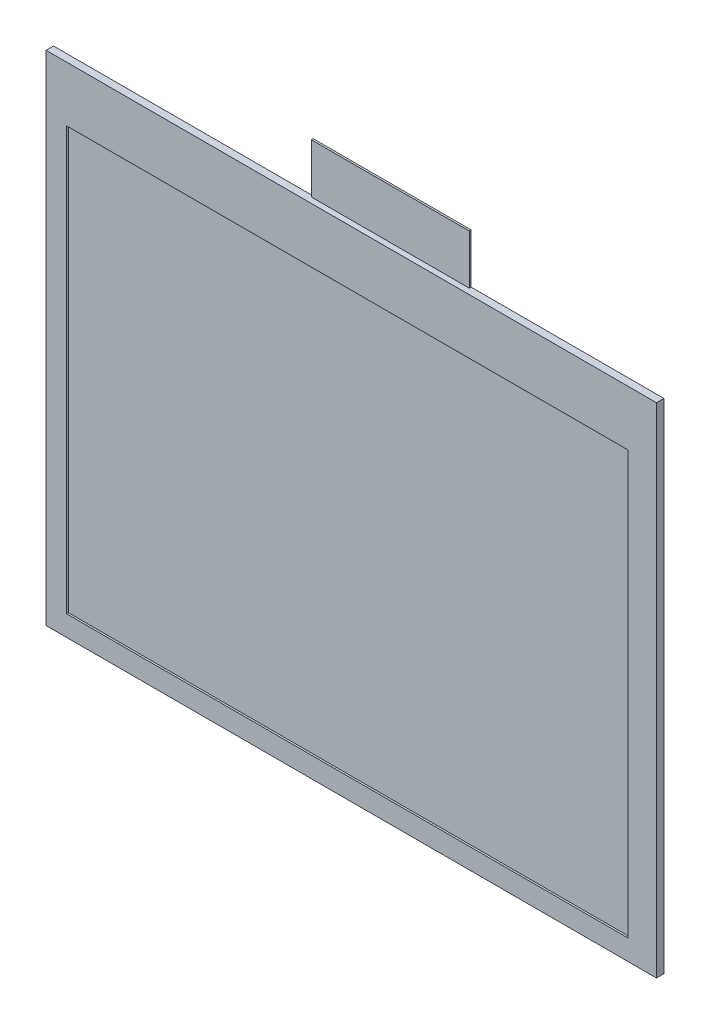
ISO-10303-21;
HEADER;
FILE_DESCRIPTION(('STEP AP214'),'2;1');
FILE_NAME('part.step','',(''),(''),'','','');
FILE_SCHEMA(('AUTOMOTIVE_DESIGN { 1 0 10303 214 1 1 1 1 }'));
ENDSEC;
DATA;
#1=APPLICATION_CONTEXT('core data for automotive mechanical design processes');
#2=APPLICATION_PROTOCOL_DEFINITION('international standard','automotive_design',2000,#1);
#3=PRODUCT_CONTEXT('',#1,'mechanical');
#4=PRODUCT('Part','Part','',(#3));
#5=PRODUCT_RELATED_PRODUCT_CATEGORY('part','',(#4));
#6=PRODUCT_DEFINITION_FORMATION('','',#4);
#7=PRODUCT_DEFINITION_CONTEXT('part definition',#1,'design');
#8=PRODUCT_DEFINITION('design','',#6,#7);
#9=PRODUCT_DEFINITION_SHAPE('','',#8);
#10=(LENGTH_UNIT() NAMED_UNIT(*) SI_UNIT(.MILLI.,.METRE.));
#11=(NAMED_UNIT(*) PLANE_ANGLE_UNIT() SI_UNIT($,.RADIAN.));
#12=(NAMED_UNIT(*) SI_UNIT($,.STERADIAN.) SOLID_ANGLE_UNIT());
#13=UNCERTAINTY_MEASURE_WITH_UNIT(LENGTH_MEASURE(1.E-05),#10,'distance_accuracy_value','');
#14=(GEOMETRIC_REPRESENTATION_CONTEXT(3) GLOBAL_UNCERTAINTY_ASSIGNED_CONTEXT((#13)) GLOBAL_UNIT_ASSIGNED_CONTEXT((#10,
#11,#12)) REPRESENTATION_CONTEXT('',''));
#15=CARTESIAN_POINT('',(0.,0.,0.));
#16=DIRECTION('',(0.,0.,1.));
#17=DIRECTION('',(1.,0.,0.));
#18=AXIS2_PLACEMENT_3D('',#15,#16,#17);
#19=CARTESIAN_POINT('',(0.,-37.4,1.2));
#20=DIRECTION('',(0.,1.,0.));
#21=DIRECTION('',(0.,0.,1.));
#22=AXIS2_PLACEMENT_3D('',#19,#20,#21);
#23=PLANE('',#22);
#24=DIRECTION('',(1.,0.,0.));
#25=VECTOR('',#24,1.);
#26=CARTESIAN_POINT('',(0.,-37.4,0.));
#27=LINE('',#26,#25);
#28=CARTESIAN_POINT('',(-48.6,-37.4,0.));
#29=VERTEX_POINT('',#28);
#30=CARTESIAN_POINT('',(49.9,-37.4,0.));
#31=VERTEX_POINT('',#30);
#32=EDGE_CURVE('E239',#29,#31,#27,.T.);
#33=ORIENTED_EDGE('',*,*,#32,.T.);
#34=DIRECTION('',(0.,0.,-1.));
#35=VECTOR('',#34,1.);
#36=CARTESIAN_POINT('',(49.9,-37.4,1.2));
#37=LINE('',#36,#35);
#38=CARTESIAN_POINT('',(49.9,-37.4,1.2));
#39=VERTEX_POINT('',#38);
#40=EDGE_CURVE('E11',#39,#31,#37,.T.);
#41=ORIENTED_EDGE('',*,*,#40,.F.);
#42=DIRECTION('',(1.,0.,0.));
#43=VECTOR('',#42,1.);
#44=CARTESIAN_POINT('',(0.,-37.4,1.2));
#45=LINE('',#44,#43);
#46=CARTESIAN_POINT('',(-48.6,-37.4,1.2));
#47=VERTEX_POINT('',#46);
#48=EDGE_CURVE('E230',#47,#39,#45,.T.);
#49=ORIENTED_EDGE('',*,*,#48,.F.);
#50=DIRECTION('',(0.,0.,-1.));
#51=VECTOR('',#50,1.);
#52=CARTESIAN_POINT('',(-48.6,-37.4,1.2));
#53=LINE('',#52,#51);
#54=EDGE_CURVE('E189',#47,#29,#53,.T.);
#55=ORIENTED_EDGE('',*,*,#54,.T.);
#56=EDGE_LOOP('',(#33,#41,#49,#55));
#57=FACE_BOUND('',#56,.T.);
#58=ADVANCED_FACE('F34',(#57),#23,.F.);
#59=CARTESIAN_POINT('',(49.9,0.,1.2));
#60=DIRECTION('',(-1.,0.,0.));
#61=DIRECTION('',(0.,0.,1.));
#62=AXIS2_PLACEMENT_3D('',#59,#60,#61);
#63=PLANE('',#62);
#64=DIRECTION('',(0.,1.,0.));
#65=VECTOR('',#64,1.);
#66=CARTESIAN_POINT('',(49.9,0.,0.));
#67=LINE('',#66,#65);
#68=CARTESIAN_POINT('',(49.9,43.,0.));
#69=VERTEX_POINT('',#68);
#70=EDGE_CURVE('E178',#31,#69,#67,.T.);
#71=ORIENTED_EDGE('',*,*,#70,.T.);
#72=DIRECTION('',(0.,0.,-1.));
#73=VECTOR('',#72,1.);
#74=CARTESIAN_POINT('',(49.9,43.,1.2));
#75=LINE('',#74,#73);
#76=CARTESIAN_POINT('',(49.9,43.,1.2));
#77=VERTEX_POINT('',#76);
#78=EDGE_CURVE('E43',#77,#69,#75,.T.);
#79=ORIENTED_EDGE('',*,*,#78,.F.);
#80=DIRECTION('',(0.,1.,0.));
#81=VECTOR('',#80,1.);
#82=CARTESIAN_POINT('',(49.9,0.,1.2));
#83=LINE('',#82,#81);
#84=EDGE_CURVE('E233',#39,#77,#83,.T.);
#85=ORIENTED_EDGE('',*,*,#84,.F.);
#86=ORIENTED_EDGE('',*,*,#40,.T.);
#87=EDGE_LOOP('',(#71,#79,#85,#86));
#88=FACE_BOUND('',#87,.T.);
#89=ADVANCED_FACE('F263',(#88),#63,.F.);
#90=CARTESIAN_POINT('',(0.,43.,1.2));
#91=DIRECTION('',(0.,1.,0.));
#92=DIRECTION('',(0.,0.,1.));
#93=AXIS2_PLACEMENT_3D('',#90,#91,#92);
#94=PLANE('',#93);
#95=DIRECTION('',(0.,0.,-1.));
#96=VECTOR('',#95,1.);
#97=CARTESIAN_POINT('',(18.8,43.,0.3));
#98=LINE('',#97,#96);
#99=CARTESIAN_POINT('',(18.8,43.,0.3));
#100=VERTEX_POINT('',#99);
#101=CARTESIAN_POINT('',(18.8,43.,0.));
#102=VERTEX_POINT('',#101);
#103=EDGE_CURVE('E132',#100,#102,#98,.T.);
#104=ORIENTED_EDGE('',*,*,#103,.F.);
#105=DIRECTION('',(1.,0.,0.));
#106=VECTOR('',#105,1.);
#107=CARTESIAN_POINT('',(0.,43.,0.3));
#108=LINE('',#107,#106);
#109=CARTESIAN_POINT('',(-6.70000000000001,43.,0.3));
#110=VERTEX_POINT('',#109);
#111=EDGE_CURVE('E136',#110,#100,#108,.T.);
#112=ORIENTED_EDGE('',*,*,#111,.F.);
#113=DIRECTION('',(0.,0.,-1.));
#114=VECTOR('',#113,1.);
#115=CARTESIAN_POINT('',(-6.70000000000001,43.,0.3));
#116=LINE('',#115,#114);
#117=CARTESIAN_POINT('',(-6.70000000000001,43.,0.));
#118=VERTEX_POINT('',#117);
#119=EDGE_CURVE('E123',#110,#118,#116,.T.);
#120=ORIENTED_EDGE('',*,*,#119,.T.);
#121=DIRECTION('',(1.,0.,0.));
#122=VECTOR('',#121,1.);
#123=CARTESIAN_POINT('',(0.,43.,0.));
#124=LINE('',#123,#122);
#125=CARTESIAN_POINT('',(-48.6,43.,0.));
#126=VERTEX_POINT('',#125);
#127=EDGE_CURVE('E177',#126,#118,#124,.T.);
#128=ORIENTED_EDGE('',*,*,#127,.F.);
#129=DIRECTION('',(0.,0.,-1.));
#130=VECTOR('',#129,1.);
#131=CARTESIAN_POINT('',(-48.6,43.,1.2));
#132=LINE('',#131,#130);
#133=CARTESIAN_POINT('',(-48.6,43.,1.2));
#134=VERTEX_POINT('',#133);
#135=EDGE_CURVE('E191',#134,#126,#132,.T.);
#136=ORIENTED_EDGE('',*,*,#135,.F.);
#137=DIRECTION('',(1.,0.,0.));
#138=VECTOR('',#137,1.);
#139=CARTESIAN_POINT('',(0.,43.,1.2));
#140=LINE('',#139,#138);
#141=EDGE_CURVE('E235',#134,#77,#140,.T.);
#142=ORIENTED_EDGE('',*,*,#141,.T.);
#143=ORIENTED_EDGE('',*,*,#78,.T.);
#144=EDGE_CURVE('E174',#102,#69,#124,.T.);
#145=ORIENTED_EDGE('',*,*,#144,.F.);
#146=EDGE_LOOP('',(#104,#112,#120,#128,#136,#142,#143,#145));
#147=FACE_BOUND('',#146,.T.);
#148=ADVANCED_FACE('F144',(#147),#94,.T.);
#149=CARTESIAN_POINT('',(45.3,0.,1.2));
#150=DIRECTION('',(-1.,0.,0.));
#151=DIRECTION('',(0.,0.,1.));
#152=AXIS2_PLACEMENT_3D('',#149,#150,#151);
#153=PLANE('',#152);
#154=DIRECTION('',(0.,1.,0.));
#155=VECTOR('',#154,1.);
#156=CARTESIAN_POINT('',(45.3,0.,0.9));
#157=LINE('',#156,#155);
#158=CARTESIAN_POINT('',(45.3,-34.1,0.9));
#159=VERTEX_POINT('',#158);
#160=CARTESIAN_POINT('',(45.3,34.1,0.9));
#161=VERTEX_POINT('',#160);
#162=EDGE_CURVE('E59',#159,#161,#157,.T.);
#163=ORIENTED_EDGE('',*,*,#162,.F.);
#164=DIRECTION('',(0.,0.,-1.));
#165=VECTOR('',#164,1.);
#166=CARTESIAN_POINT('',(45.3,-34.1,1.2));
#167=LINE('',#166,#165);
#168=CARTESIAN_POINT('',(45.3,-34.1,1.2));
#169=VERTEX_POINT('',#168);
#170=EDGE_CURVE('E192',#169,#159,#167,.T.);
#171=ORIENTED_EDGE('',*,*,#170,.F.);
#172=DIRECTION('',(0.,1.,0.));
#173=VECTOR('',#172,1.);
#174=CARTESIAN_POINT('',(45.3,0.,1.2));
#175=LINE('',#174,#173);
#176=CARTESIAN_POINT('',(45.3,34.1,1.2));
#177=VERTEX_POINT('',#176);
#178=EDGE_CURVE('E188',#169,#177,#175,.T.);
#179=ORIENTED_EDGE('',*,*,#178,.T.);
#180=DIRECTION('',(0.,0.,-1.));
#181=VECTOR('',#180,1.);
#182=CARTESIAN_POINT('',(45.3,34.1,1.2));
#183=LINE('',#182,#181);
#184=EDGE_CURVE('E196',#177,#161,#183,.T.);
#185=ORIENTED_EDGE('',*,*,#184,.T.);
#186=EDGE_LOOP('',(#163,#171,#179,#185));
#187=FACE_BOUND('',#186,.T.);
#188=ADVANCED_FACE('F36',(#187),#153,.T.);
#189=CARTESIAN_POINT('',(0.,-34.1,1.2));
#190=DIRECTION('',(0.,1.,0.));
#191=DIRECTION('',(0.,0.,1.));
#192=AXIS2_PLACEMENT_3D('',#189,#190,#191);
#193=PLANE('',#192);
#194=DIRECTION('',(1.,0.,0.));
#195=VECTOR('',#194,1.);
#196=CARTESIAN_POINT('',(0.,-34.1,0.9));
#197=LINE('',#196,#195);
#198=CARTESIAN_POINT('',(-45.3,-34.1,0.9));
#199=VERTEX_POINT('',#198);
#200=EDGE_CURVE('E131',#199,#159,#197,.T.);
#201=ORIENTED_EDGE('',*,*,#200,.F.);
#202=DIRECTION('',(0.,0.,-1.));
#203=VECTOR('',#202,1.);
#204=CARTESIAN_POINT('',(-45.3,-34.1,1.2));
#205=LINE('',#204,#203);
#206=CARTESIAN_POINT('',(-45.3,-34.1,1.2));
#207=VERTEX_POINT('',#206);
#208=EDGE_CURVE('E203',#207,#199,#205,.T.);
#209=ORIENTED_EDGE('',*,*,#208,.F.);
#210=DIRECTION('',(1.,0.,0.));
#211=VECTOR('',#210,1.);
#212=CARTESIAN_POINT('',(0.,-34.1,1.2));
#213=LINE('',#212,#211);
#214=EDGE_CURVE('E211',#207,#169,#213,.T.);
#215=ORIENTED_EDGE('',*,*,#214,.T.);
#216=ORIENTED_EDGE('',*,*,#170,.T.);
#217=EDGE_LOOP('',(#201,#209,#215,#216));
#218=FACE_BOUND('',#217,.T.);
#219=ADVANCED_FACE('F209',(#218),#193,.T.);
#220=CARTESIAN_POINT('',(-45.3,0.,1.2));
#221=DIRECTION('',(-1.,0.,0.));
#222=DIRECTION('',(0.,0.,1.));
#223=AXIS2_PLACEMENT_3D('',#220,#221,#222);
#224=PLANE('',#223);
#225=ORIENTED_EDGE('',*,*,#208,.T.);
#226=DIRECTION('',(0.,1.,0.));
#227=VECTOR('',#226,1.);
#228=CARTESIAN_POINT('',(-45.3,0.,0.9));
#229=LINE('',#228,#227);
#230=CARTESIAN_POINT('',(-45.3,34.1,0.9));
#231=VERTEX_POINT('',#230);
#232=EDGE_CURVE('E225',#199,#231,#229,.T.);
#233=ORIENTED_EDGE('',*,*,#232,.T.);
#234=DIRECTION('',(0.,0.,-1.));
#235=VECTOR('',#234,1.);
#236=CARTESIAN_POINT('',(-45.3,34.1,1.2));
#237=LINE('',#236,#235);
#238=CARTESIAN_POINT('',(-45.3,34.1,1.2));
#239=VERTEX_POINT('',#238);
#240=EDGE_CURVE('E199',#239,#231,#237,.T.);
#241=ORIENTED_EDGE('',*,*,#240,.F.);
#242=DIRECTION('',(0.,1.,0.));
#243=VECTOR('',#242,1.);
#244=CARTESIAN_POINT('',(-45.3,0.,1.2));
#245=LINE('',#244,#243);
#246=EDGE_CURVE('E222',#207,#239,#245,.T.);
#247=ORIENTED_EDGE('',*,*,#246,.F.);
#248=EDGE_LOOP('',(#225,#233,#241,#247));
#249=FACE_BOUND('',#248,.T.);
#250=ADVANCED_FACE('F276',(#249),#224,.F.);
#251=CARTESIAN_POINT('',(0.,34.1,1.2));
#252=DIRECTION('',(0.,1.,0.));
#253=DIRECTION('',(0.,0.,1.));
#254=AXIS2_PLACEMENT_3D('',#251,#252,#253);
#255=PLANE('',#254);
#256=ORIENTED_EDGE('',*,*,#240,.T.);
#257=DIRECTION('',(1.,0.,0.));
#258=VECTOR('',#257,1.);
#259=CARTESIAN_POINT('',(0.,34.1,0.9));
#260=LINE('',#259,#258);
#261=EDGE_CURVE('E246',#231,#161,#260,.T.);
#262=ORIENTED_EDGE('',*,*,#261,.T.);
#263=ORIENTED_EDGE('',*,*,#184,.F.);
#264=DIRECTION('',(1.,0.,0.));
#265=VECTOR('',#264,1.);
#266=CARTESIAN_POINT('',(0.,34.1,1.2));
#267=LINE('',#266,#265);
#268=EDGE_CURVE('E219',#239,#177,#267,.T.);
#269=ORIENTED_EDGE('',*,*,#268,.F.);
#270=EDGE_LOOP('',(#256,#262,#263,#269));
#271=FACE_BOUND('',#270,.T.);
#272=ADVANCED_FACE('F272',(#271),#255,.F.);
#273=CARTESIAN_POINT('',(-48.6,0.,1.2));
#274=DIRECTION('',(-1.,0.,0.));
#275=DIRECTION('',(0.,0.,1.));
#276=AXIS2_PLACEMENT_3D('',#273,#274,#275);
#277=PLANE('',#276);
#278=DIRECTION('',(0.,1.,0.));
#279=VECTOR('',#278,1.);
#280=CARTESIAN_POINT('',(-48.6,0.,0.));
#281=LINE('',#280,#279);
#282=EDGE_CURVE('E184',#29,#126,#281,.T.);
#283=ORIENTED_EDGE('',*,*,#282,.F.);
#284=ORIENTED_EDGE('',*,*,#54,.F.);
#285=DIRECTION('',(0.,1.,0.));
#286=VECTOR('',#285,1.);
#287=CARTESIAN_POINT('',(-48.6,0.,1.2));
#288=LINE('',#287,#286);
#289=EDGE_CURVE('E200',#47,#134,#288,.T.);
#290=ORIENTED_EDGE('',*,*,#289,.T.);
#291=ORIENTED_EDGE('',*,*,#135,.T.);
#292=EDGE_LOOP('',(#283,#284,#290,#291));
#293=FACE_BOUND('',#292,.T.);
#294=ADVANCED_FACE('F275',(#293),#277,.T.);
#295=CARTESIAN_POINT('',(0.,0.,1.2));
#296=DIRECTION('',(0.,0.,1.));
#297=DIRECTION('',(1.,0.,0.));
#298=AXIS2_PLACEMENT_3D('',#295,#296,#297);
#299=PLANE('',#298);
#300=ORIENTED_EDGE('',*,*,#178,.F.);
#301=ORIENTED_EDGE('',*,*,#214,.F.);
#302=ORIENTED_EDGE('',*,*,#246,.T.);
#303=ORIENTED_EDGE('',*,*,#268,.T.);
#304=EDGE_LOOP('',(#300,#301,#302,#303));
#305=FACE_BOUND('',#304,.T.);
#306=ORIENTED_EDGE('',*,*,#48,.T.);
#307=ORIENTED_EDGE('',*,*,#84,.T.);
#308=ORIENTED_EDGE('',*,*,#141,.F.);
#309=ORIENTED_EDGE('',*,*,#289,.F.);
#310=EDGE_LOOP('',(#306,#307,#308,#309));
#311=FACE_BOUND('',#310,.T.);
#312=ADVANCED_FACE('F216',(#305,#311),#299,.T.);
#313=CARTESIAN_POINT('',(0.,0.,0.));
#314=DIRECTION('',(0.,0.,1.));
#315=DIRECTION('',(1.,0.,0.));
#316=AXIS2_PLACEMENT_3D('',#313,#314,#315);
#317=PLANE('',#316);
#318=ORIENTED_EDGE('',*,*,#32,.F.);
#319=ORIENTED_EDGE('',*,*,#282,.T.);
#320=ORIENTED_EDGE('',*,*,#127,.T.);
#321=DIRECTION('',(0.,1.,0.));
#322=VECTOR('',#321,1.);
#323=CARTESIAN_POINT('',(-6.70000000000001,0.,0.));
#324=LINE('',#323,#322);
#325=CARTESIAN_POINT('',(-6.70000000000001,51.,0.));
#326=VERTEX_POINT('',#325);
#327=EDGE_CURVE('E51',#118,#326,#324,.T.);
#328=ORIENTED_EDGE('',*,*,#327,.T.);
#329=DIRECTION('',(-1.,0.,0.));
#330=VECTOR('',#329,1.);
#331=CARTESIAN_POINT('',(0.,51.,0.));
#332=LINE('',#331,#330);
#333=CARTESIAN_POINT('',(18.8,51.,0.));
#334=VERTEX_POINT('',#333);
#335=EDGE_CURVE('E141',#334,#326,#332,.T.);
#336=ORIENTED_EDGE('',*,*,#335,.F.);
#337=DIRECTION('',(0.,1.,0.));
#338=VECTOR('',#337,1.);
#339=CARTESIAN_POINT('',(18.8,0.,0.));
#340=LINE('',#339,#338);
#341=EDGE_CURVE('E154',#102,#334,#340,.T.);
#342=ORIENTED_EDGE('',*,*,#341,.F.);
#343=ORIENTED_EDGE('',*,*,#144,.T.);
#344=ORIENTED_EDGE('',*,*,#70,.F.);
#345=EDGE_LOOP('',(#318,#319,#320,#328,#336,#342,#343,#344));
#346=FACE_BOUND('',#345,.T.);
#347=ADVANCED_FACE('F252',(#346),#317,.F.);
#348=CARTESIAN_POINT('',(0.,0.,0.9));
#349=DIRECTION('',(0.,0.,1.));
#350=DIRECTION('',(1.,0.,0.));
#351=AXIS2_PLACEMENT_3D('',#348,#349,#350);
#352=PLANE('',#351);
#353=ORIENTED_EDGE('',*,*,#200,.T.);
#354=ORIENTED_EDGE('',*,*,#162,.T.);
#355=ORIENTED_EDGE('',*,*,#261,.F.);
#356=ORIENTED_EDGE('',*,*,#232,.F.);
#357=EDGE_LOOP('',(#353,#354,#355,#356));
#358=FACE_BOUND('',#357,.T.);
#359=ADVANCED_FACE('F250',(#358),#352,.T.);
#360=CARTESIAN_POINT('',(-6.70000000000001,0.,0.3));
#361=DIRECTION('',(-1.,0.,0.));
#362=DIRECTION('',(0.,0.,1.));
#363=AXIS2_PLACEMENT_3D('',#360,#361,#362);
#364=PLANE('',#363);
#365=ORIENTED_EDGE('',*,*,#327,.F.);
#366=ORIENTED_EDGE('',*,*,#119,.F.);
#367=DIRECTION('',(0.,1.,0.));
#368=VECTOR('',#367,1.);
#369=CARTESIAN_POINT('',(-6.70000000000001,0.,0.3));
#370=LINE('',#369,#368);
#371=CARTESIAN_POINT('',(-6.70000000000001,51.,0.3));
#372=VERTEX_POINT('',#371);
#373=EDGE_CURVE('E126',#110,#372,#370,.T.);
#374=ORIENTED_EDGE('',*,*,#373,.T.);
#375=DIRECTION('',(0.,0.,-1.));
#376=VECTOR('',#375,1.);
#377=CARTESIAN_POINT('',(-6.70000000000001,51.,0.3));
#378=LINE('',#377,#376);
#379=EDGE_CURVE('E151',#372,#326,#378,.T.);
#380=ORIENTED_EDGE('',*,*,#379,.T.);
#381=EDGE_LOOP('',(#365,#366,#374,#380));
#382=FACE_BOUND('',#381,.T.);
#383=ADVANCED_FACE('F125',(#382),#364,.T.);
#384=CARTESIAN_POINT('',(18.8,0.,0.3));
#385=DIRECTION('',(-1.,0.,0.));
#386=DIRECTION('',(0.,0.,1.));
#387=AXIS2_PLACEMENT_3D('',#384,#385,#386);
#388=PLANE('',#387);
#389=ORIENTED_EDGE('',*,*,#341,.T.);
#390=DIRECTION('',(0.,0.,-1.));
#391=VECTOR('',#390,1.);
#392=CARTESIAN_POINT('',(18.8,51.,0.3));
#393=LINE('',#392,#391);
#394=CARTESIAN_POINT('',(18.8,51.,0.3));
#395=VERTEX_POINT('',#394);
#396=EDGE_CURVE('E156',#395,#334,#393,.T.);
#397=ORIENTED_EDGE('',*,*,#396,.F.);
#398=DIRECTION('',(0.,1.,0.));
#399=VECTOR('',#398,1.);
#400=CARTESIAN_POINT('',(18.8,0.,0.3));
#401=LINE('',#400,#399);
#402=EDGE_CURVE('E146',#100,#395,#401,.T.);
#403=ORIENTED_EDGE('',*,*,#402,.F.);
#404=ORIENTED_EDGE('',*,*,#103,.T.);
#405=EDGE_LOOP('',(#389,#397,#403,#404));
#406=FACE_BOUND('',#405,.T.);
#407=ADVANCED_FACE('F258',(#406),#388,.F.);
#408=CARTESIAN_POINT('',(0.,51.,0.3));
#409=DIRECTION('',(0.,-1.,0.));
#410=DIRECTION('',(0.,0.,-1.));
#411=AXIS2_PLACEMENT_3D('',#408,#409,#410);
#412=PLANE('',#411);
#413=ORIENTED_EDGE('',*,*,#335,.T.);
#414=ORIENTED_EDGE('',*,*,#379,.F.);
#415=DIRECTION('',(-1.,0.,0.));
#416=VECTOR('',#415,1.);
#417=CARTESIAN_POINT('',(0.,51.,0.3));
#418=LINE('',#417,#416);
#419=EDGE_CURVE('E139',#395,#372,#418,.T.);
#420=ORIENTED_EDGE('',*,*,#419,.F.);
#421=ORIENTED_EDGE('',*,*,#396,.T.);
#422=EDGE_LOOP('',(#413,#414,#420,#421));
#423=FACE_BOUND('',#422,.T.);
#424=ADVANCED_FACE('F319',(#423),#412,.F.);
#425=CARTESIAN_POINT('',(0.,0.,0.3));
#426=DIRECTION('',(0.,0.,1.));
#427=DIRECTION('',(1.,0.,0.));
#428=AXIS2_PLACEMENT_3D('',#425,#426,#427);
#429=PLANE('',#428);
#430=ORIENTED_EDGE('',*,*,#373,.F.);
#431=ORIENTED_EDGE('',*,*,#111,.T.);
#432=ORIENTED_EDGE('',*,*,#402,.T.);
#433=ORIENTED_EDGE('',*,*,#419,.T.);
#434=EDGE_LOOP('',(#430,#431,#432,#433));
#435=FACE_BOUND('',#434,.T.);
#436=ADVANCED_FACE('F135',(#435),#429,.T.);
#437=CLOSED_SHELL('',(#58,#89,#148,#188,#219,#250,#272,#294,#312,#347,#359,#383,#407,#424,#436));
#438=MANIFOLD_SOLID_BREP('B2',#437);
#439=ADVANCED_BREP_SHAPE_REPRESENTATION('',(#18,#438),#14);
#440=SHAPE_DEFINITION_REPRESENTATION(#9,#439);
ENDSEC;
END-ISO-10303-21;
